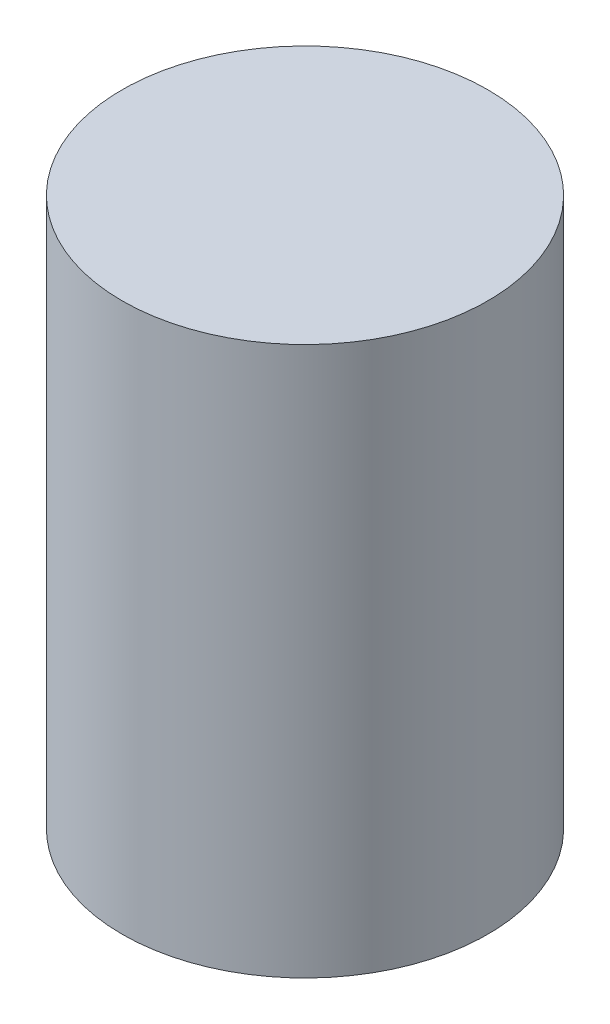
ISO-10303-21;
HEADER;
FILE_DESCRIPTION(('STEP AP214'),'2;1');
FILE_NAME('part.step','',(''),(''),'','','');
FILE_SCHEMA(('AUTOMOTIVE_DESIGN { 1 0 10303 214 1 1 1 1 }'));
ENDSEC;
DATA;
#1=APPLICATION_CONTEXT('core data for automotive mechanical design processes');
#2=APPLICATION_PROTOCOL_DEFINITION('international standard','automotive_design',2000,#1);
#3=PRODUCT_CONTEXT('',#1,'mechanical');
#4=PRODUCT('Part','Part','',(#3));
#5=PRODUCT_RELATED_PRODUCT_CATEGORY('part','',(#4));
#6=PRODUCT_DEFINITION_FORMATION('','',#4);
#7=PRODUCT_DEFINITION_CONTEXT('part definition',#1,'design');
#8=PRODUCT_DEFINITION('design','',#6,#7);
#9=PRODUCT_DEFINITION_SHAPE('','',#8);
#10=(LENGTH_UNIT() NAMED_UNIT(*) SI_UNIT(.MILLI.,.METRE.));
#11=(NAMED_UNIT(*) PLANE_ANGLE_UNIT() SI_UNIT($,.RADIAN.));
#12=(NAMED_UNIT(*) SI_UNIT($,.STERADIAN.) SOLID_ANGLE_UNIT());
#13=UNCERTAINTY_MEASURE_WITH_UNIT(LENGTH_MEASURE(1.E-05),#10,'distance_accuracy_value','');
#14=(GEOMETRIC_REPRESENTATION_CONTEXT(3) GLOBAL_UNCERTAINTY_ASSIGNED_CONTEXT((#13)) GLOBAL_UNIT_ASSIGNED_CONTEXT((#10,
#11,#12)) REPRESENTATION_CONTEXT('',''));
#15=CARTESIAN_POINT('',(0.,0.,0.));
#16=DIRECTION('',(0.,0.,1.));
#17=DIRECTION('',(1.,0.,0.));
#18=AXIS2_PLACEMENT_3D('',#15,#16,#17);
#19=CARTESIAN_POINT('',(0.,4.572,0.));
#20=DIRECTION('',(0.,-1.,0.));
#21=DIRECTION('',(0.,0.,-1.));
#22=AXIS2_PLACEMENT_3D('',#19,#20,#21);
#23=CYLINDRICAL_SURFACE('',#22,1.524);
#24=CARTESIAN_POINT('',(0.,4.572,0.));
#25=DIRECTION('',(0.,1.,0.));
#26=DIRECTION('',(0.,0.,1.));
#27=AXIS2_PLACEMENT_3D('',#24,#25,#26);
#28=CIRCLE('',#27,1.524);
#29=CARTESIAN_POINT('',(0.,4.572,1.524));
#30=VERTEX_POINT('',#29);
#31=EDGE_CURVE('E10',#30,#30,#28,.T.);
#32=ORIENTED_EDGE('',*,*,#31,.F.);
#33=EDGE_LOOP('',(#32));
#34=FACE_BOUND('',#33,.T.);
#35=CARTESIAN_POINT('',(0.,0.,0.));
#36=DIRECTION('',(0.,1.,0.));
#37=DIRECTION('',(0.,0.,1.));
#38=AXIS2_PLACEMENT_3D('',#35,#36,#37);
#39=CIRCLE('',#38,1.524);
#40=CARTESIAN_POINT('',(0.,0.,1.524));
#41=VERTEX_POINT('',#40);
#42=EDGE_CURVE('E33',#41,#41,#39,.T.);
#43=ORIENTED_EDGE('',*,*,#42,.T.);
#44=EDGE_LOOP('',(#43));
#45=FACE_BOUND('',#44,.T.);
#46=ADVANCED_FACE('F30',(#34,#45),#23,.T.);
#47=CARTESIAN_POINT('',(0.,4.572,0.));
#48=DIRECTION('',(0.,1.,0.));
#49=DIRECTION('',(0.,0.,1.));
#50=AXIS2_PLACEMENT_3D('',#47,#48,#49);
#51=PLANE('',#50);
#52=ORIENTED_EDGE('',*,*,#31,.T.);
#53=EDGE_LOOP('',(#52));
#54=FACE_BOUND('',#53,.T.);
#55=ADVANCED_FACE('F45',(#54),#51,.T.);
#56=CARTESIAN_POINT('',(0.,0.,0.));
#57=DIRECTION('',(0.,1.,0.));
#58=DIRECTION('',(0.,0.,1.));
#59=AXIS2_PLACEMENT_3D('',#56,#57,#58);
#60=PLANE('',#59);
#61=ORIENTED_EDGE('',*,*,#42,.F.);
#62=EDGE_LOOP('',(#61));
#63=FACE_BOUND('',#62,.T.);
#64=ADVANCED_FACE('F43',(#63),#60,.F.);
#65=CLOSED_SHELL('',(#46,#55,#64));
#66=MANIFOLD_SOLID_BREP('B2',#65);
#67=ADVANCED_BREP_SHAPE_REPRESENTATION('',(#18,#66),#14);
#68=SHAPE_DEFINITION_REPRESENTATION(#9,#67);
ENDSEC;
END-ISO-10303-21;
